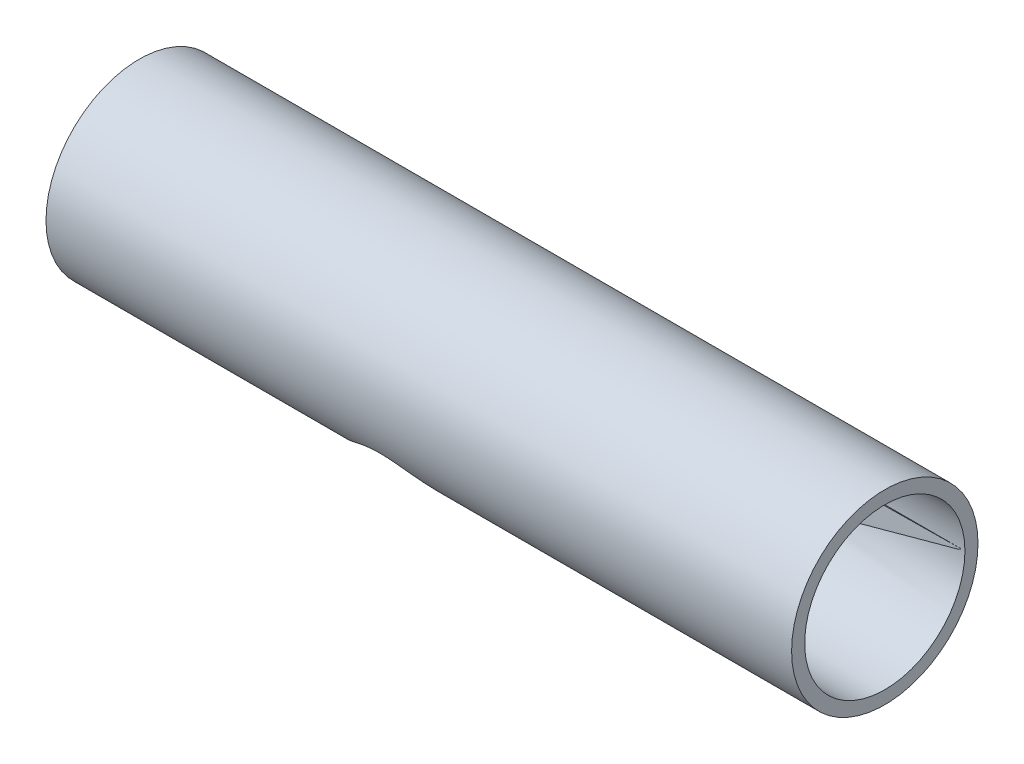
ISO-10303-21;
HEADER;
FILE_DESCRIPTION(('STEP AP214'),'2;1');
FILE_NAME('part.step','',(''),(''),'','','');
FILE_SCHEMA(('AUTOMOTIVE_DESIGN { 1 0 10303 214 1 1 1 1 }'));
ENDSEC;
DATA;
#1=APPLICATION_CONTEXT('core data for automotive mechanical design processes');
#2=APPLICATION_PROTOCOL_DEFINITION('international standard','automotive_design',2000,#1);
#3=PRODUCT_CONTEXT('',#1,'mechanical');
#4=PRODUCT('Part','Part','',(#3));
#5=PRODUCT_RELATED_PRODUCT_CATEGORY('part','',(#4));
#6=PRODUCT_DEFINITION_FORMATION('','',#4);
#7=PRODUCT_DEFINITION_CONTEXT('part definition',#1,'design');
#8=PRODUCT_DEFINITION('design','',#6,#7);
#9=PRODUCT_DEFINITION_SHAPE('','',#8);
#10=(LENGTH_UNIT() NAMED_UNIT(*) SI_UNIT(.MILLI.,.METRE.));
#11=(NAMED_UNIT(*) PLANE_ANGLE_UNIT() SI_UNIT($,.RADIAN.));
#12=(NAMED_UNIT(*) SI_UNIT($,.STERADIAN.) SOLID_ANGLE_UNIT());
#13=UNCERTAINTY_MEASURE_WITH_UNIT(LENGTH_MEASURE(1.E-05),#10,'distance_accuracy_value','');
#14=(GEOMETRIC_REPRESENTATION_CONTEXT(3) GLOBAL_UNCERTAINTY_ASSIGNED_CONTEXT((#13)) GLOBAL_UNIT_ASSIGNED_CONTEXT((#10,
#11,#12)) REPRESENTATION_CONTEXT('',''));
#15=CARTESIAN_POINT('',(0.,0.,0.));
#16=DIRECTION('',(0.,0.,1.));
#17=DIRECTION('',(1.,0.,0.));
#18=AXIS2_PLACEMENT_3D('',#15,#16,#17);
#19=CARTESIAN_POINT('',(200.,0.,0.));
#20=DIRECTION('',(-1.,0.,0.));
#21=DIRECTION('',(0.,0.,1.));
#22=AXIS2_PLACEMENT_3D('',#19,#20,#21);
#23=CYLINDRICAL_SURFACE('',#22,25.);
#24=CARTESIAN_POINT('',(86.,-12.7573508221731,21.5));
#25=CARTESIAN_POINT('',(85.6411300903029,-12.7573509918839,21.4999999684605));
#26=CARTESIAN_POINT('',(85.2822592876509,-12.7725703244095,21.4909911049313));
#27=CARTESIAN_POINT('',(84.5677678456575,-12.8325538353862,21.4552266183063));
#28=CARTESIAN_POINT('',(84.2121487742128,-12.8773315755468,21.4284628490441));
#29=CARTESIAN_POINT('',(83.5063615508435,-12.9941034971422,21.3578532707336));
#30=CARTESIAN_POINT('',(83.1562078688,-13.0661602358882,21.3139681912797));
#31=CARTESIAN_POINT('',(82.4639977013857,-13.2340636599463,21.2101217236544));
#32=CARTESIAN_POINT('',(82.1219447018528,-13.3299203900592,21.1501535467429));
#33=CARTESIAN_POINT('',(81.5446082903782,-13.5110526095547,21.0347192474702));
#34=CARTESIAN_POINT('',(81.3070021191927,-13.5913972690556,20.9829490319248));
#35=CARTESIAN_POINT('',(80.8367446487539,-13.760855430875,20.8722092193337));
#36=CARTESIAN_POINT('',(80.6040919056057,-13.8499663341092,20.813241754944));
#37=CARTESIAN_POINT('',(79.9132700087825,-14.1287096832877,20.6259435834598));
#38=CARTESIAN_POINT('',(79.462436922379,-14.3296880380091,20.487257564513));
#39=CARTESIAN_POINT('',(78.5787513445668,-14.75378533458,20.1840047421979));
#40=CARTESIAN_POINT('',(78.1459576911182,-14.976969737085,20.0193605302));
#41=CARTESIAN_POINT('',(77.298642919303,-15.4381786101222,19.6658854822539));
#42=CARTESIAN_POINT('',(76.8841205415506,-15.6762020551036,19.4770563168191));
#43=CARTESIAN_POINT('',(76.1673950327854,-16.1049117037574,19.1230239325437));
#44=CARTESIAN_POINT('',(75.8616133756646,-16.2936364420653,18.9626369952601));
#45=CARTESIAN_POINT('',(75.2598295724422,-16.6747445401104,18.6283972473423));
#46=CARTESIAN_POINT('',(74.9638283154987,-16.8671282299996,18.454543217163));
#47=CARTESIAN_POINT('',(74.0899181226812,-17.4473342258096,17.9128505492508));
#48=CARTESIAN_POINT('',(73.5262382220332,-17.8381287520899,17.524948489579));
#49=CARTESIAN_POINT('',(72.4374476076126,-18.6158100504239,16.69654103397));
#50=CARTESIAN_POINT('',(71.9122971857409,-19.0027004808817,16.2560910590479));
#51=CARTESIAN_POINT('',(70.9016674289867,-19.7635820522449,15.3219921433386));
#52=CARTESIAN_POINT('',(70.4161714328717,-20.1375785720957,14.8283657494627));
#53=CARTESIAN_POINT('',(69.5922067551786,-20.7825821266885,13.904204197845));
#54=CARTESIAN_POINT('',(69.2451608275581,-21.0578962483758,13.4842972314029));
#55=CARTESIAN_POINT('',(68.5793366035289,-21.591429371623,12.6123505257751));
#56=CARTESIAN_POINT('',(68.2605574145677,-21.8496489128973,12.1603118019965));
#57=CARTESIAN_POINT('',(67.6545600866951,-22.3444541419994,11.2251806249901));
#58=CARTESIAN_POINT('',(67.3673000307915,-22.5810684902823,10.7421308030862));
#59=CARTESIAN_POINT('',(66.9624151735837,-22.9166743411195,9.99502976705397));
#60=CARTESIAN_POINT('',(66.8317921870418,-23.025319952855,9.74225164471815));
#61=CARTESIAN_POINT('',(66.5796044592136,-23.235682076831,9.22929787590668));
#62=CARTESIAN_POINT('',(66.4580420768658,-23.3373967840154,8.96912032717163));
#63=CARTESIAN_POINT('',(66.1502584572102,-23.595580331817,8.27406814474828));
#64=CARTESIAN_POINT('',(65.9720402606518,-23.7457672878794,7.83324806563359));
#65=CARTESIAN_POINT('',(65.6434109085114,-24.0235930204759,6.93456205429875));
#66=CARTESIAN_POINT('',(65.4929942081444,-24.1512362929404,6.47669954298668));
#67=CARTESIAN_POINT('',(65.2220381473877,-24.3817272817369,5.54625545053439));
#68=CARTESIAN_POINT('',(65.1014882767189,-24.4845837203242,5.07367911334742));
#69=CARTESIAN_POINT('',(64.8920859712716,-24.6635576937638,4.11654370990282));
#70=CARTESIAN_POINT('',(64.8032338909707,-24.7396749295905,3.6319845097052));
#71=CARTESIAN_POINT('',(64.6584009203503,-24.8638785002184,2.65192292565288));
#72=CARTESIAN_POINT('',(64.6025838745861,-24.91182510817,2.15637843671397));
#73=CARTESIAN_POINT('',(64.5255427199107,-24.9780288633293,1.16061880515502));
#74=CARTESIAN_POINT('',(64.5043186862759,-24.996285945931,0.660403652373748));
#75=CARTESIAN_POINT('',(64.4968718226198,-25.0026902201131,-0.340431232483208));
#76=CARTESIAN_POINT('',(64.5106456628034,-24.9908402761599,-0.841050921539848));
#77=CARTESIAN_POINT('',(64.572923438513,-24.9373085086853,-1.83849361443861));
#78=CARTESIAN_POINT('',(64.6214257922808,-24.8956280438364,-2.33531679015662));
#79=CARTESIAN_POINT('',(64.7471018182698,-24.7877940344119,-3.28242929582675));
#80=CARTESIAN_POINT('',(64.8217264777773,-24.7238179853122,-3.73331047774133));
#81=CARTESIAN_POINT('',(64.9985548786821,-24.5725172217632,-4.6255970557257));
#82=CARTESIAN_POINT('',(65.1007568506715,-24.4851940053118,-5.06700305777847));
#83=CARTESIAN_POINT('',(65.3313324584716,-24.2886842410276,-5.93794132319741));
#84=CARTESIAN_POINT('',(65.4597075317074,-24.1794964924021,-6.36747293295081));
#85=CARTESIAN_POINT('',(65.7410271306283,-23.9409778620075,-7.21265769645277));
#86=CARTESIAN_POINT('',(65.8939731827152,-23.8116457288415,-7.62830998604943));
#87=CARTESIAN_POINT('',(66.2350703522069,-23.5243144335651,-8.47473061890352));
#88=CARTESIAN_POINT('',(66.4250006563802,-23.3648933962567,-8.90429797392625));
#89=CARTESIAN_POINT('',(66.8292077415209,-23.0273081776405,-9.74412375900501));
#90=CARTESIAN_POINT('',(67.0434850721447,-22.8491435731861,-10.1543817528388));
#91=CARTESIAN_POINT('',(67.4945110654652,-22.4763650669044,-10.9548168739378));
#92=CARTESIAN_POINT('',(67.731270064626,-22.2817436032046,-11.344984635867));
#93=CARTESIAN_POINT('',(68.2253931141368,-21.8784435478612,-12.1044902157429));
#94=CARTESIAN_POINT('',(68.4827613544431,-21.6697620991309,-12.4738237718498));
#95=CARTESIAN_POINT('',(69.1514591887307,-21.1321098072123,-13.3727294952137));
#96=CARTESIAN_POINT('',(69.5748504435919,-20.7956574671812,-13.8889255164778));
#97=CARTESIAN_POINT('',(70.4604034095451,-20.1035478567973,-14.8731155109487));
#98=CARTESIAN_POINT('',(70.9225830081672,-19.7478817531138,-15.3410870209786));
#99=CARTESIAN_POINT('',(71.8837037201369,-19.0241815605676,-16.229898197329));
#100=CARTESIAN_POINT('',(72.3827244933407,-18.6561216659882,-16.6506304607575));
#101=CARTESIAN_POINT('',(73.4149808464373,-17.9165490840782,-17.4439402879738));
#102=CARTESIAN_POINT('',(73.9482061609001,-17.5450374610361,-17.8165321993418));
#103=CARTESIAN_POINT('',(74.9397317996386,-16.8811257655957,-18.4443197465682));
#104=CARTESIAN_POINT('',(75.3918861924987,-16.5876645767852,-18.7081357380435));
#105=CARTESIAN_POINT('',(76.3192534885331,-16.0104619494605,-19.2044234874157));
#106=CARTESIAN_POINT('',(76.7944704464999,-15.7267222352172,-19.4368897061396));
#107=CARTESIAN_POINT('',(77.7681104302656,-15.1773808018522,-19.8687894852488));
#108=CARTESIAN_POINT('',(78.2664710893071,-14.9117346099738,-20.0683058930208));
#109=CARTESIAN_POINT('',(79.2887230746648,-14.4080951304571,-20.4328988305916));
#110=CARTESIAN_POINT('',(79.8125964595036,-14.1700827971642,-20.5979991436392));
#111=CARTESIAN_POINT('',(80.9835357602258,-13.6960143732452,-20.9168512880886));
#112=CARTESIAN_POINT('',(81.6359629893793,-13.4678044952609,-21.0633869885102));
#113=CARTESIAN_POINT('',(82.6391036768262,-13.1887332361862,-21.2383961370493));
#114=CARTESIAN_POINT('',(82.9772727931504,-13.1062928675736,-21.2892428173299));
#115=CARTESIAN_POINT('',(83.6607128866123,-12.9657457480337,-21.3751311079764));
#116=CARTESIAN_POINT('',(84.0059836189257,-12.9076381597173,-21.410173262243));
#117=CARTESIAN_POINT('',(84.705185008541,-12.8181543253097,-21.4638701961176));
#118=CARTESIAN_POINT('',(85.0591691920397,-12.7870803505452,-21.4823397421337));
#119=CARTESIAN_POINT('',(85.7689776064291,-12.7545178750989,-21.5016893858796));
#120=CARTESIAN_POINT('',(86.1248017121774,-12.7530273880936,-21.5025706645383));
#121=CARTESIAN_POINT('',(86.8351523033779,-12.7797263143765,-21.4867127483525));
#122=CARTESIAN_POINT('',(87.1896778024451,-12.8079348952749,-21.4699621740116));
#123=CARTESIAN_POINT('',(87.8941097781725,-12.8924492643753,-21.4193168381773));
#124=CARTESIAN_POINT('',(88.244015487587,-12.9487596608916,-21.3854192647976));
#125=CARTESIAN_POINT('',(88.9962384161048,-13.0984448976197,-21.2941229233379));
#126=CARTESIAN_POINT('',(89.397245528283,-13.1965219544005,-21.2336894465938));
#127=CARTESIAN_POINT('',(90.1872425748407,-13.4216008129277,-21.0921364792368));
#128=CARTESIAN_POINT('',(90.5762292455102,-13.5486103932232,-21.0110114249614));
#129=CARTESIAN_POINT('',(91.342352585938,-13.8261638342664,-20.8294204094856));
#130=CARTESIAN_POINT('',(91.7194494924324,-13.9767782966033,-20.7288962102533));
#131=CARTESIAN_POINT('',(92.4605373504773,-14.29603690619,-20.5100164877133));
#132=CARTESIAN_POINT('',(92.8245276263259,-14.4646819812197,-20.3916600467049));
#133=CARTESIAN_POINT('',(93.4836628679382,-14.7880428890639,-20.1580530751978));
#134=CARTESIAN_POINT('',(93.7806472148368,-14.9407909682846,-20.0452302879362));
#135=CARTESIAN_POINT('',(94.3659649016407,-15.2537960113155,-19.8080872296075));
#136=CARTESIAN_POINT('',(94.6542969933174,-15.4140540500978,-19.6837653100646));
#137=CARTESIAN_POINT('',(95.5070751545741,-15.9033599992966,-19.2939549464551));
#138=CARTESIAN_POINT('',(96.0591112204595,-16.2408428651451,-19.0116905262386));
#139=CARTESIAN_POINT('',(97.1325925202797,-16.9267363121228,-18.4037032705222));
#140=CARTESIAN_POINT('',(97.6539947014814,-17.2751612641896,-18.0779212842836));
#141=CARTESIAN_POINT('',(98.6662388162491,-17.9735799663078,-17.3836951724049));
#142=CARTESIAN_POINT('',(99.1570878846119,-18.3235733294824,-17.0152610648426));
#143=CARTESIAN_POINT('',(100.133880057336,-19.0367883869143,-16.2143068998155));
#144=CARTESIAN_POINT('',(100.618095305269,-19.3996903747347,-15.7793874613213));
#145=CARTESIAN_POINT('',(101.550300603915,-20.1114740200319,-14.8615637035033));
#146=CARTESIAN_POINT('',(101.998283728614,-20.4603529905327,-14.3786502489366));
#147=CARTESIAN_POINT('',(102.853578817502,-21.1358592412809,-13.3658110189468));
#148=CARTESIAN_POINT('',(103.260984544273,-21.4625372386784,-12.8359992322305));
#149=CARTESIAN_POINT('',(103.838626323285,-21.9306624193996,-12.0061220940683));
#150=CARTESIAN_POINT('',(104.025572132574,-22.0830358613509,-11.723678151937));
#151=CARTESIAN_POINT('',(104.387726449127,-22.3796261551301,-11.1470823602357));
#152=CARTESIAN_POINT('',(104.562932198547,-22.5238410892204,-10.8529277854227));
#153=CARTESIAN_POINT('',(104.969181311948,-22.8596146638108,-10.1318246322164));
#154=CARTESIAN_POINT('',(105.194123184627,-23.0467107269119,-9.69931574818896));
#155=CARTESIAN_POINT('',(105.616835335728,-23.3999307153391,-8.81309897155618));
#156=CARTESIAN_POINT('',(105.814612730763,-23.5660601326264,-8.35939667315136));
#157=CARTESIAN_POINT('',(106.180564513327,-23.8745785938093,-7.43255688903533));
#158=CARTESIAN_POINT('',(106.348750646078,-24.0169770556899,-6.95942720673413));
#159=CARTESIAN_POINT('',(106.653182591939,-24.2754501897362,-5.99593734793645));
#160=CARTESIAN_POINT('',(106.789427663691,-24.3915242509042,-5.50557677181045));
#161=CARTESIAN_POINT('',(107.028588509571,-24.59568302208,-4.50709203112021));
#162=CARTESIAN_POINT('',(107.131253536174,-24.6835570703038,-3.9988642686984));
#163=CARTESIAN_POINT('',(107.299957222453,-24.8281349472708,-2.97195731541469));
#164=CARTESIAN_POINT('',(107.365995898221,-24.8848387897079,-2.45327812914447));
#165=CARTESIAN_POINT('',(107.460091515267,-24.965675381647,-1.41017070665346));
#166=CARTESIAN_POINT('',(107.488164471309,-24.9898218645366,-0.885744988611938));
#167=CARTESIAN_POINT('',(107.505781418604,-25.0049716962499,0.164207167307825));
#168=CARTESIAN_POINT('',(107.495328997596,-24.9959781312954,0.689733498134407));
#169=CARTESIAN_POINT('',(107.439423838402,-24.9479203391497,1.67888428186474));
#170=CARTESIAN_POINT('',(107.397979787116,-24.9123003550927,2.14291235526911));
#171=CARTESIAN_POINT('',(107.285519869755,-24.8157716260179,3.06466453307971));
#172=CARTESIAN_POINT('',(107.214506626196,-24.7548651236838,3.5223891928226));
#173=CARTESIAN_POINT('',(107.044005718387,-24.6089056560953,4.42859404565376));
#174=CARTESIAN_POINT('',(106.94451583253,-24.52385080691,4.87707351455026));
#175=CARTESIAN_POINT('',(106.718492335867,-24.3311003202811,5.76218164563847));
#176=CARTESIAN_POINT('',(106.591957314306,-24.2234035017689,6.19880968828457));
#177=CARTESIAN_POINT('',(106.310067439756,-23.984226865759,7.06861262676475));
#178=CARTESIAN_POINT('',(106.154080989077,-23.8522278116891,7.50143922336876));
#179=CARTESIAN_POINT('',(105.817332076645,-23.5683780729941,8.35056814253847));
#180=CARTESIAN_POINT('',(105.636569947064,-23.4165276545208,8.76687068654853));
#181=CARTESIAN_POINT('',(105.252118900531,-23.0950850905266,9.58169546616073));
#182=CARTESIAN_POINT('',(105.048426903273,-22.9254905615503,9.98021530284111));
#183=CARTESIAN_POINT('',(104.619911478288,-22.5707039653894,10.7585475243454));
#184=CARTESIAN_POINT('',(104.395083715885,-22.3855086995059,11.1383560472696));
#185=CARTESIAN_POINT('',(103.814347243669,-21.9103004059621,12.0547578274139));
#186=CARTESIAN_POINT('',(103.446953099104,-21.6123277974991,12.5800028601278));
#187=CARTESIAN_POINT('',(102.674305558568,-20.9935437736656,13.5875286983211));
#188=CARTESIAN_POINT('',(102.269036687399,-20.6727230356522,14.0697917832315));
#189=CARTESIAN_POINT('',(101.423005900137,-20.013706670968,14.9924593367427));
#190=CARTESIAN_POINT('',(100.982142253784,-19.675462321885,15.4327353789197));
#191=CARTESIAN_POINT('',(100.068493446563,-18.9889843268545,16.2699548128525));
#192=CARTESIAN_POINT('',(99.5957134217253,-18.6407522933027,16.6669051498692));
#193=CARTESIAN_POINT('',(98.6096375566195,-17.9341074854067,17.4253188348616));
#194=CARTESIAN_POINT('',(98.0957200765182,-17.5756304648032,17.7859126268194));
#195=CARTESIAN_POINT('',(97.0355398221368,-16.8635214440219,18.4624641052915));
#196=CARTESIAN_POINT('',(96.4892637160085,-16.5098915157927,18.7784032098571));
#197=CARTESIAN_POINT('',(95.6454740947365,-15.991760283096,19.2175676247883));
#198=CARTESIAN_POINT('',(95.3604788374278,-15.8212849672339,19.3580280469949));
#199=CARTESIAN_POINT('',(94.7818327932712,-15.4859581457491,19.6273093080727));
#200=CARTESIAN_POINT('',(94.4881832210205,-15.3211058578978,19.7561317700636));
#201=CARTESIAN_POINT('',(93.8921383385198,-14.999100841762,20.0016984739194));
#202=CARTESIAN_POINT('',(93.5897515434,-14.8419409940074,20.1184539996085));
#203=CARTESIAN_POINT('',(92.9755514937942,-14.5374404251587,20.3395729844043));
#204=CARTESIAN_POINT('',(92.6637368817845,-14.3901011280207,20.4439346481385));
#205=CARTESIAN_POINT('',(92.0151682684773,-14.1012036775425,20.6443315393614));
#206=CARTESIAN_POINT('',(91.6779363617107,-13.9602655128547,20.7397238652191));
#207=CARTESIAN_POINT('',(90.9928122826253,-13.6959250528219,20.9152293023296));
#208=CARTESIAN_POINT('',(90.6449226963903,-13.5725185437579,20.9953460866352));
#209=CARTESIAN_POINT('',(89.9399771796378,-13.3477434197338,21.1389569907715));
#210=CARTESIAN_POINT('',(89.5829556292942,-13.2463027897359,21.2025055736149));
#211=CARTESIAN_POINT('',(88.8600244775329,-13.0693198051478,21.3120567254834));
#212=CARTESIAN_POINT('',(88.4941201392486,-12.9937624970474,21.3580694272065));
#213=CARTESIAN_POINT('',(87.7749341629184,-12.8756103316044,21.4294937180733));
#214=CARTESIAN_POINT('',(87.4220014186663,-12.8314902359357,21.4558619109544));
#215=CARTESIAN_POINT('',(86.7127132237491,-12.7723572607017,21.4911169511617));
#216=CARTESIAN_POINT('',(86.3563570521213,-12.7573506536507,21.5000000313186));
#217=CARTESIAN_POINT('',(86.,-12.7573508221731,21.5));
#218=B_SPLINE_CURVE_WITH_KNOTS('',3,(#24,#25,#26,#27,#28,#29,#30,#31,#32,#33,#34,#35,#36,#37,
#38,#39,#40,#41,#42,#43,#44,#45,#46,#47,#48,#49,#50,#51,#52,#53,#54,#55,#56,#57,#58,#59,#60,#61,
#62,#63,#64,#65,#66,#67,#68,#69,#70,#71,#72,#73,#74,#75,#76,#77,#78,#79,#80,#81,#82,#83,#84,#85,
#86,#87,#88,#89,#90,#91,#92,#93,#94,#95,#96,#97,#98,#99,#100,#101,#102,#103,#104,#105,#106,#107,
#108,#109,#110,#111,#112,#113,#114,#115,#116,#117,#118,#119,#120,#121,#122,#123,#124,#125,#126,
#127,#128,#129,#130,#131,#132,#133,#134,#135,#136,#137,#138,#139,#140,#141,#142,#143,#144,#145,
#146,#147,#148,#149,#150,#151,#152,#153,#154,#155,#156,#157,#158,#159,#160,#161,#162,#163,#164,
#165,#166,#167,#168,#169,#170,#171,#172,#173,#174,#175,#176,#177,#178,#179,#180,#181,#182,#183,
#184,#185,#186,#187,#188,#189,#190,#191,#192,#193,#194,#195,#196,#197,#198,#199,#200,#201,#202,
#203,#204,#205,#206,#207,#208,#209,#210,#211,#212,#213,#214,#215,#216,#217),.UNSPECIFIED.,.T.,
.F.,(4,2,2,2,2,2,2,2,2,2,2,2,2,2,2,2,2,2,2,2,2,2,2,2,2,2,2,2,2,2,2,2,2,2,2,2,2,2,2,2,2,2,2,2,2,
2,2,2,2,2,2,2,2,2,2,2,2,2,2,2,2,2,2,2,2,2,2,2,2,2,2,2,2,2,2,2,2,2,2,2,2,2,2,2,2,2,2,2,2,2,2,2,2,
2,2,2,4),(0.,1.07619045970101,2.15287503046416,3.23204380351421,4.31166881693438,5.079697820697,
5.84749979561606,7.38374277756963,8.92465671901226,10.465464283128,11.645598604542,
12.8258399210738,15.1868378983963,17.5453674424863,19.9029008721546,21.7324597412281,
23.5619608194393,25.3889985933383,26.3024487062121,27.2161358121264,28.7104662835393,
30.2044984003877,31.6980040110759,33.1915263231664,34.6923953271422,36.1932675970891,
37.6939970752198,39.1946582048998,40.5775409852484,41.9603350585419,43.3432050952621,
44.7261610720694,46.2127405423715,47.6993535802313,49.1866534629984,50.6742564923267,
52.9138489106376,55.1544798691639,57.4001061466244,59.6450615941104,61.4442577531796,
63.2437713958114,65.0386891746839,66.8323624329253,68.944414841758,69.9986707616169,
71.0528903972963,72.1187514424478,73.1845409222707,74.2510186784879,75.317671379997,
76.5673680290797,77.8174010582067,79.0712468825281,80.3251572555847,81.3822772283613,
82.4395489817756,84.5547671036149,86.6728901355015,88.7905166707997,91.0236457967832,
93.2572007964918,95.4854687481847,96.5992932846243,97.7133785578197,99.2783783269483,
100.8429673086,102.406933873326,103.970936734501,105.546364926929,107.121792427229,
108.69655517053,110.271171265145,111.671221532728,113.071147655132,114.471183022653,
115.871291438068,117.305793190131,118.740275711461,120.17495116582,121.609921498349,
123.727392621318,125.845732734148,127.970357322831,130.094640825049,132.261452840337,
134.429163883053,135.510616048158,136.591917152002,137.672197801543,138.752634749935,
139.885096459851,141.017285521362,142.145704537753,143.273470531485,144.34189518722,
145.410550009977),.UNSPECIFIED.);
#219=CARTESIAN_POINT('',(86.,-12.7573508221731,21.5));
#220=VERTEX_POINT('',#219);
#221=EDGE_CURVE('E57',#220,#220,#218,.T.);
#222=ORIENTED_EDGE('',*,*,#221,.F.);
#223=EDGE_LOOP('',(#222));
#224=FACE_BOUND('',#223,.T.);
#225=CARTESIAN_POINT('',(200.,0.,0.));
#226=DIRECTION('',(1.,0.,0.));
#227=DIRECTION('',(0.,0.,-1.));
#228=AXIS2_PLACEMENT_3D('',#225,#226,#227);
#229=CIRCLE('',#228,25.);
#230=CARTESIAN_POINT('',(200.,0.,-25.));
#231=VERTEX_POINT('',#230);
#232=EDGE_CURVE('E11',#231,#231,#229,.T.);
#233=ORIENTED_EDGE('',*,*,#232,.F.);
#234=EDGE_LOOP('',(#233));
#235=FACE_BOUND('',#234,.T.);
#236=CARTESIAN_POINT('',(0.,0.,0.));
#237=DIRECTION('',(1.,0.,0.));
#238=DIRECTION('',(0.,0.,-1.));
#239=AXIS2_PLACEMENT_3D('',#236,#237,#238);
#240=CIRCLE('',#239,25.);
#241=CARTESIAN_POINT('',(0.,0.,-25.));
#242=VERTEX_POINT('',#241);
#243=EDGE_CURVE('E38',#242,#242,#240,.T.);
#244=ORIENTED_EDGE('',*,*,#243,.T.);
#245=EDGE_LOOP('',(#244));
#246=FACE_BOUND('',#245,.T.);
#247=ADVANCED_FACE('F35',(#224,#235,#246),#23,.T.);
#248=CARTESIAN_POINT('',(200.,0.,0.));
#249=DIRECTION('',(1.,0.,0.));
#250=DIRECTION('',(0.,0.,-1.));
#251=AXIS2_PLACEMENT_3D('',#248,#249,#250);
#252=PLANE('',#251);
#253=CARTESIAN_POINT('',(200.,0.,0.));
#254=DIRECTION('',(1.,0.,0.));
#255=DIRECTION('',(0.,0.,-1.));
#256=AXIS2_PLACEMENT_3D('',#253,#254,#255);
#257=CIRCLE('',#256,21.5);
#258=CARTESIAN_POINT('',(200.,0.,-21.5));
#259=VERTEX_POINT('',#258);
#260=EDGE_CURVE('E107',#259,#259,#257,.T.);
#261=ORIENTED_EDGE('',*,*,#260,.F.);
#262=EDGE_LOOP('',(#261));
#263=FACE_BOUND('',#262,.T.);
#264=ORIENTED_EDGE('',*,*,#232,.T.);
#265=EDGE_LOOP('',(#264));
#266=FACE_BOUND('',#265,.T.);
#267=ADVANCED_FACE('F84',(#263,#266),#252,.T.);
#268=CARTESIAN_POINT('',(0.,0.,0.));
#269=DIRECTION('',(1.,0.,0.));
#270=DIRECTION('',(0.,0.,-1.));
#271=AXIS2_PLACEMENT_3D('',#268,#269,#270);
#272=PLANE('',#271);
#273=CARTESIAN_POINT('',(0.,0.,0.));
#274=DIRECTION('',(-1.,0.,0.));
#275=DIRECTION('',(0.,0.,1.));
#276=AXIS2_PLACEMENT_3D('',#273,#274,#275);
#277=CIRCLE('',#276,10.);
#278=CARTESIAN_POINT('',(0.,0.,10.));
#279=VERTEX_POINT('',#278);
#280=EDGE_CURVE('E67',#279,#279,#277,.T.);
#281=ORIENTED_EDGE('',*,*,#280,.F.);
#282=EDGE_LOOP('',(#281));
#283=FACE_BOUND('',#282,.T.);
#284=ORIENTED_EDGE('',*,*,#243,.F.);
#285=EDGE_LOOP('',(#284));
#286=FACE_BOUND('',#285,.T.);
#287=ADVANCED_FACE('F83',(#283,#286),#272,.F.);
#288=CARTESIAN_POINT('',(10.,0.,0.));
#289=DIRECTION('',(1.,0.,0.));
#290=DIRECTION('',(0.,0.,-1.));
#291=AXIS2_PLACEMENT_3D('',#288,#289,#290);
#292=CYLINDRICAL_SURFACE('',#291,21.5);
#293=CARTESIAN_POINT('',(86.,0.,0.));
#294=DIRECTION('',(-0.707106781186547,0.707106781186547,0.));
#295=DIRECTION('',(0.707106781186547,0.707106781186547,0.));
#296=AXIS2_PLACEMENT_3D('',#293,#294,#295);
#297=ELLIPSE('',#296,30.4055915910215,21.5);
#298=CARTESIAN_POINT('',(86.,0.,-21.5));
#299=VERTEX_POINT('',#298);
#300=CARTESIAN_POINT('',(86.,0.,21.5));
#301=VERTEX_POINT('',#300);
#302=EDGE_CURVE('E50',#299,#301,#297,.T.);
#303=ORIENTED_EDGE('',*,*,#302,.F.);
#304=CARTESIAN_POINT('',(86.,0.,0.));
#305=DIRECTION('',(0.707106781186547,0.707106781186547,0.));
#306=DIRECTION('',(-0.707106781186547,0.707106781186547,0.));
#307=AXIS2_PLACEMENT_3D('',#304,#305,#306);
#308=ELLIPSE('',#307,30.4055915910215,21.5);
#309=EDGE_CURVE('E48',#301,#299,#308,.T.);
#310=ORIENTED_EDGE('',*,*,#309,.F.);
#311=EDGE_LOOP('',(#303,#310));
#312=FACE_BOUND('',#311,.T.);
#313=CARTESIAN_POINT('',(10.,0.,0.));
#314=DIRECTION('',(1.,0.,0.));
#315=DIRECTION('',(0.,0.,-1.));
#316=AXIS2_PLACEMENT_3D('',#313,#314,#315);
#317=CIRCLE('',#316,21.5);
#318=CARTESIAN_POINT('',(10.,0.,-21.5));
#319=VERTEX_POINT('',#318);
#320=EDGE_CURVE('E105',#319,#319,#317,.T.);
#321=ORIENTED_EDGE('',*,*,#320,.F.);
#322=EDGE_LOOP('',(#321));
#323=FACE_BOUND('',#322,.T.);
#324=ORIENTED_EDGE('',*,*,#260,.T.);
#325=EDGE_LOOP('',(#324));
#326=FACE_BOUND('',#325,.T.);
#327=ADVANCED_FACE('F55',(#312,#323,#326),#292,.F.);
#328=CARTESIAN_POINT('',(10.,0.,0.));
#329=DIRECTION('',(1.,0.,0.));
#330=DIRECTION('',(0.,0.,-1.));
#331=AXIS2_PLACEMENT_3D('',#328,#329,#330);
#332=PLANE('',#331);
#333=CARTESIAN_POINT('',(10.,0.,0.));
#334=DIRECTION('',(1.,0.,0.));
#335=DIRECTION('',(0.,0.,-1.));
#336=AXIS2_PLACEMENT_3D('',#333,#334,#335);
#337=CIRCLE('',#336,10.);
#338=CARTESIAN_POINT('',(10.,0.,-10.));
#339=VERTEX_POINT('',#338);
#340=EDGE_CURVE('E60',#339,#339,#337,.F.);
#341=ORIENTED_EDGE('',*,*,#340,.T.);
#342=EDGE_LOOP('',(#341));
#343=FACE_BOUND('',#342,.T.);
#344=ORIENTED_EDGE('',*,*,#320,.T.);
#345=EDGE_LOOP('',(#344));
#346=FACE_BOUND('',#345,.T.);
#347=ADVANCED_FACE('F76',(#343,#346),#332,.T.);
#348=CARTESIAN_POINT('',(200.001,0.,0.));
#349=DIRECTION('',(-1.,0.,0.));
#350=DIRECTION('',(0.,0.,1.));
#351=AXIS2_PLACEMENT_3D('',#348,#349,#350);
#352=CYLINDRICAL_SURFACE('',#351,10.);
#353=ORIENTED_EDGE('',*,*,#340,.F.);
#354=EDGE_LOOP('',(#353));
#355=FACE_BOUND('',#354,.T.);
#356=ORIENTED_EDGE('',*,*,#280,.T.);
#357=EDGE_LOOP('',(#356));
#358=FACE_BOUND('',#357,.T.);
#359=ADVANCED_FACE('F73',(#355,#358),#352,.F.);
#360=CARTESIAN_POINT('',(86.,-25.001,0.));
#361=DIRECTION('',(0.,1.,0.));
#362=DIRECTION('',(0.,0.,1.));
#363=AXIS2_PLACEMENT_3D('',#360,#361,#362);
#364=CYLINDRICAL_SURFACE('',#363,21.5);
#365=ORIENTED_EDGE('',*,*,#309,.T.);
#366=ORIENTED_EDGE('',*,*,#302,.T.);
#367=EDGE_LOOP('',(#365,#366));
#368=FACE_BOUND('',#367,.T.);
#369=ORIENTED_EDGE('',*,*,#221,.T.);
#370=EDGE_LOOP('',(#369));
#371=FACE_BOUND('',#370,.T.);
#372=ADVANCED_FACE('F51',(#368,#371),#364,.F.);
#373=CLOSED_SHELL('',(#247,#267,#287,#327,#347,#359,#372));
#374=MANIFOLD_SOLID_BREP('B2',#373);
#375=ADVANCED_BREP_SHAPE_REPRESENTATION('',(#18,#374),#14);
#376=SHAPE_DEFINITION_REPRESENTATION(#9,#375);
ENDSEC;
END-ISO-10303-21;
